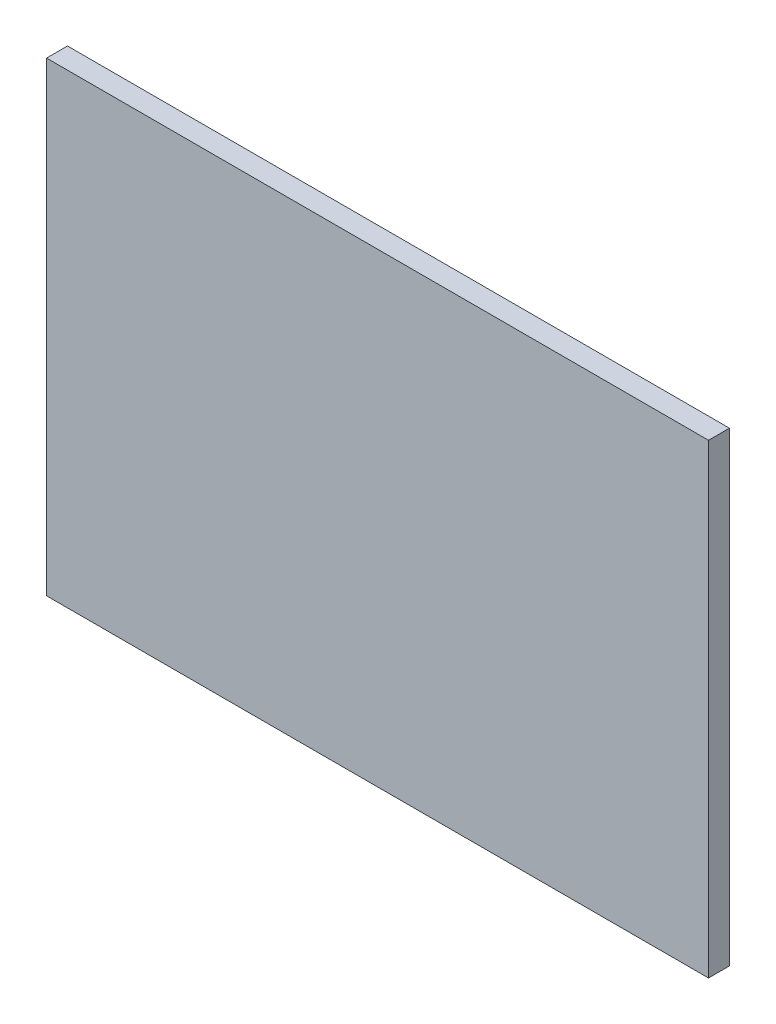
ISO-10303-21;
HEADER;
FILE_DESCRIPTION(('STEP AP214'),'2;1');
FILE_NAME('part.step','',(''),(''),'','','');
FILE_SCHEMA(('AUTOMOTIVE_DESIGN { 1 0 10303 214 1 1 1 1 }'));
ENDSEC;
DATA;
#1=APPLICATION_CONTEXT('core data for automotive mechanical design processes');
#2=APPLICATION_PROTOCOL_DEFINITION('international standard','automotive_design',2000,#1);
#3=PRODUCT_CONTEXT('',#1,'mechanical');
#4=PRODUCT('Part','Part','',(#3));
#5=PRODUCT_RELATED_PRODUCT_CATEGORY('part','',(#4));
#6=PRODUCT_DEFINITION_FORMATION('','',#4);
#7=PRODUCT_DEFINITION_CONTEXT('part definition',#1,'design');
#8=PRODUCT_DEFINITION('design','',#6,#7);
#9=PRODUCT_DEFINITION_SHAPE('','',#8);
#10=(LENGTH_UNIT() NAMED_UNIT(*) SI_UNIT(.MILLI.,.METRE.));
#11=(NAMED_UNIT(*) PLANE_ANGLE_UNIT() SI_UNIT($,.RADIAN.));
#12=(NAMED_UNIT(*) SI_UNIT($,.STERADIAN.) SOLID_ANGLE_UNIT());
#13=UNCERTAINTY_MEASURE_WITH_UNIT(LENGTH_MEASURE(1.E-05),#10,'distance_accuracy_value','');
#14=(GEOMETRIC_REPRESENTATION_CONTEXT(3) GLOBAL_UNCERTAINTY_ASSIGNED_CONTEXT((#13)) GLOBAL_UNIT_ASSIGNED_CONTEXT((#10,
#11,#12)) REPRESENTATION_CONTEXT('',''));
#15=CARTESIAN_POINT('',(0.,0.,0.));
#16=DIRECTION('',(0.,0.,1.));
#17=DIRECTION('',(1.,0.,0.));
#18=AXIS2_PLACEMENT_3D('',#15,#16,#17);
#19=CARTESIAN_POINT('',(-12.65,8.9,0.8));
#20=DIRECTION('',(1.,0.,0.));
#21=DIRECTION('',(0.,0.,-1.));
#22=AXIS2_PLACEMENT_3D('',#19,#20,#21);
#23=PLANE('',#22);
#24=DIRECTION('',(0.,-1.,0.));
#25=VECTOR('',#24,1.);
#26=CARTESIAN_POINT('',(-12.65,8.9,0.));
#27=LINE('',#26,#25);
#28=CARTESIAN_POINT('',(-12.65,8.9,0.));
#29=VERTEX_POINT('',#28);
#30=CARTESIAN_POINT('',(-12.65,-8.9,0.));
#31=VERTEX_POINT('',#30);
#32=EDGE_CURVE('E111',#29,#31,#27,.T.);
#33=ORIENTED_EDGE('',*,*,#32,.T.);
#34=DIRECTION('',(0.,0.,-1.));
#35=VECTOR('',#34,1.);
#36=CARTESIAN_POINT('',(-12.65,-8.9,0.8));
#37=LINE('',#36,#35);
#38=CARTESIAN_POINT('',(-12.65,-8.9,0.8));
#39=VERTEX_POINT('',#38);
#40=EDGE_CURVE('E11',#39,#31,#37,.T.);
#41=ORIENTED_EDGE('',*,*,#40,.F.);
#42=DIRECTION('',(0.,-1.,0.));
#43=VECTOR('',#42,1.);
#44=CARTESIAN_POINT('',(-12.65,8.9,0.8));
#45=LINE('',#44,#43);
#46=CARTESIAN_POINT('',(-12.65,8.9,0.8));
#47=VERTEX_POINT('',#46);
#48=EDGE_CURVE('E95',#47,#39,#45,.T.);
#49=ORIENTED_EDGE('',*,*,#48,.F.);
#50=DIRECTION('',(0.,0.,-1.));
#51=VECTOR('',#50,1.);
#52=CARTESIAN_POINT('',(-12.65,8.9,0.8));
#53=LINE('',#52,#51);
#54=EDGE_CURVE('E107',#47,#29,#53,.T.);
#55=ORIENTED_EDGE('',*,*,#54,.T.);
#56=EDGE_LOOP('',(#33,#41,#49,#55));
#57=FACE_BOUND('',#56,.T.);
#58=ADVANCED_FACE('F43',(#57),#23,.F.);
#59=CARTESIAN_POINT('',(-12.65,-8.9,0.8));
#60=DIRECTION('',(0.,1.,0.));
#61=DIRECTION('',(0.,0.,1.));
#62=AXIS2_PLACEMENT_3D('',#59,#60,#61);
#63=PLANE('',#62);
#64=DIRECTION('',(1.,0.,0.));
#65=VECTOR('',#64,1.);
#66=CARTESIAN_POINT('',(-12.65,-8.9,0.));
#67=LINE('',#66,#65);
#68=CARTESIAN_POINT('',(12.65,-8.9,0.));
#69=VERTEX_POINT('',#68);
#70=EDGE_CURVE('E100',#31,#69,#67,.T.);
#71=ORIENTED_EDGE('',*,*,#70,.T.);
#72=DIRECTION('',(0.,0.,-1.));
#73=VECTOR('',#72,1.);
#74=CARTESIAN_POINT('',(12.65,-8.9,0.8));
#75=LINE('',#74,#73);
#76=CARTESIAN_POINT('',(12.65,-8.9,0.8));
#77=VERTEX_POINT('',#76);
#78=EDGE_CURVE('E52',#77,#69,#75,.T.);
#79=ORIENTED_EDGE('',*,*,#78,.F.);
#80=DIRECTION('',(1.,0.,0.));
#81=VECTOR('',#80,1.);
#82=CARTESIAN_POINT('',(-12.65,-8.9,0.8));
#83=LINE('',#82,#81);
#84=EDGE_CURVE('E90',#39,#77,#83,.T.);
#85=ORIENTED_EDGE('',*,*,#84,.F.);
#86=ORIENTED_EDGE('',*,*,#40,.T.);
#87=EDGE_LOOP('',(#71,#79,#85,#86));
#88=FACE_BOUND('',#87,.T.);
#89=ADVANCED_FACE('F99',(#88),#63,.F.);
#90=CARTESIAN_POINT('',(12.65,8.9,0.8));
#91=DIRECTION('',(-1.,0.,0.));
#92=DIRECTION('',(0.,-1.,0.));
#93=AXIS2_PLACEMENT_3D('',#90,#91,#92);
#94=PLANE('',#93);
#95=DIRECTION('',(0.,1.,0.));
#96=VECTOR('',#95,1.);
#97=CARTESIAN_POINT('',(12.65,8.9,0.));
#98=LINE('',#97,#96);
#99=CARTESIAN_POINT('',(12.65,8.9,0.));
#100=VERTEX_POINT('',#99);
#101=EDGE_CURVE('E77',#69,#100,#98,.T.);
#102=ORIENTED_EDGE('',*,*,#101,.T.);
#103=DIRECTION('',(0.,0.,-1.));
#104=VECTOR('',#103,1.);
#105=CARTESIAN_POINT('',(12.65,8.9,0.8));
#106=LINE('',#105,#104);
#107=CARTESIAN_POINT('',(12.65,8.9,0.8));
#108=VERTEX_POINT('',#107);
#109=EDGE_CURVE('E102',#108,#100,#106,.T.);
#110=ORIENTED_EDGE('',*,*,#109,.F.);
#111=DIRECTION('',(0.,1.,0.));
#112=VECTOR('',#111,1.);
#113=CARTESIAN_POINT('',(12.65,8.9,0.8));
#114=LINE('',#113,#112);
#115=EDGE_CURVE('E93',#77,#108,#114,.T.);
#116=ORIENTED_EDGE('',*,*,#115,.F.);
#117=ORIENTED_EDGE('',*,*,#78,.T.);
#118=EDGE_LOOP('',(#102,#110,#116,#117));
#119=FACE_BOUND('',#118,.T.);
#120=ADVANCED_FACE('F103',(#119),#94,.F.);
#121=CARTESIAN_POINT('',(-12.65,8.9,0.8));
#122=DIRECTION('',(0.,-1.,0.));
#123=DIRECTION('',(0.,0.,-1.));
#124=AXIS2_PLACEMENT_3D('',#121,#122,#123);
#125=PLANE('',#124);
#126=DIRECTION('',(-1.,0.,0.));
#127=VECTOR('',#126,1.);
#128=CARTESIAN_POINT('',(-12.65,8.9,0.));
#129=LINE('',#128,#127);
#130=EDGE_CURVE('E83',#100,#29,#129,.T.);
#131=ORIENTED_EDGE('',*,*,#130,.T.);
#132=ORIENTED_EDGE('',*,*,#54,.F.);
#133=DIRECTION('',(-1.,0.,0.));
#134=VECTOR('',#133,1.);
#135=CARTESIAN_POINT('',(-12.65,8.9,0.8));
#136=LINE('',#135,#134);
#137=EDGE_CURVE('E60',#108,#47,#136,.T.);
#138=ORIENTED_EDGE('',*,*,#137,.F.);
#139=ORIENTED_EDGE('',*,*,#109,.T.);
#140=EDGE_LOOP('',(#131,#132,#138,#139));
#141=FACE_BOUND('',#140,.T.);
#142=ADVANCED_FACE('F124',(#141),#125,.F.);
#143=CARTESIAN_POINT('',(0.,0.,0.8));
#144=DIRECTION('',(0.,0.,1.));
#145=DIRECTION('',(1.,0.,0.));
#146=AXIS2_PLACEMENT_3D('',#143,#144,#145);
#147=PLANE('',#146);
#148=ORIENTED_EDGE('',*,*,#48,.T.);
#149=ORIENTED_EDGE('',*,*,#84,.T.);
#150=ORIENTED_EDGE('',*,*,#115,.T.);
#151=ORIENTED_EDGE('',*,*,#137,.T.);
#152=EDGE_LOOP('',(#148,#149,#150,#151));
#153=FACE_BOUND('',#152,.T.);
#154=ADVANCED_FACE('F91',(#153),#147,.T.);
#155=CARTESIAN_POINT('',(0.,0.,0.));
#156=DIRECTION('',(0.,0.,1.));
#157=DIRECTION('',(1.,0.,0.));
#158=AXIS2_PLACEMENT_3D('',#155,#156,#157);
#159=PLANE('',#158);
#160=ORIENTED_EDGE('',*,*,#32,.F.);
#161=ORIENTED_EDGE('',*,*,#130,.F.);
#162=ORIENTED_EDGE('',*,*,#101,.F.);
#163=ORIENTED_EDGE('',*,*,#70,.F.);
#164=EDGE_LOOP('',(#160,#161,#162,#163));
#165=FACE_BOUND('',#164,.T.);
#166=ADVANCED_FACE('F127',(#165),#159,.F.);
#167=CLOSED_SHELL('',(#58,#89,#120,#142,#154,#166));
#168=MANIFOLD_SOLID_BREP('B2',#167);
#169=ADVANCED_BREP_SHAPE_REPRESENTATION('',(#18,#168),#14);
#170=SHAPE_DEFINITION_REPRESENTATION(#9,#169);
ENDSEC;
END-ISO-10303-21;
